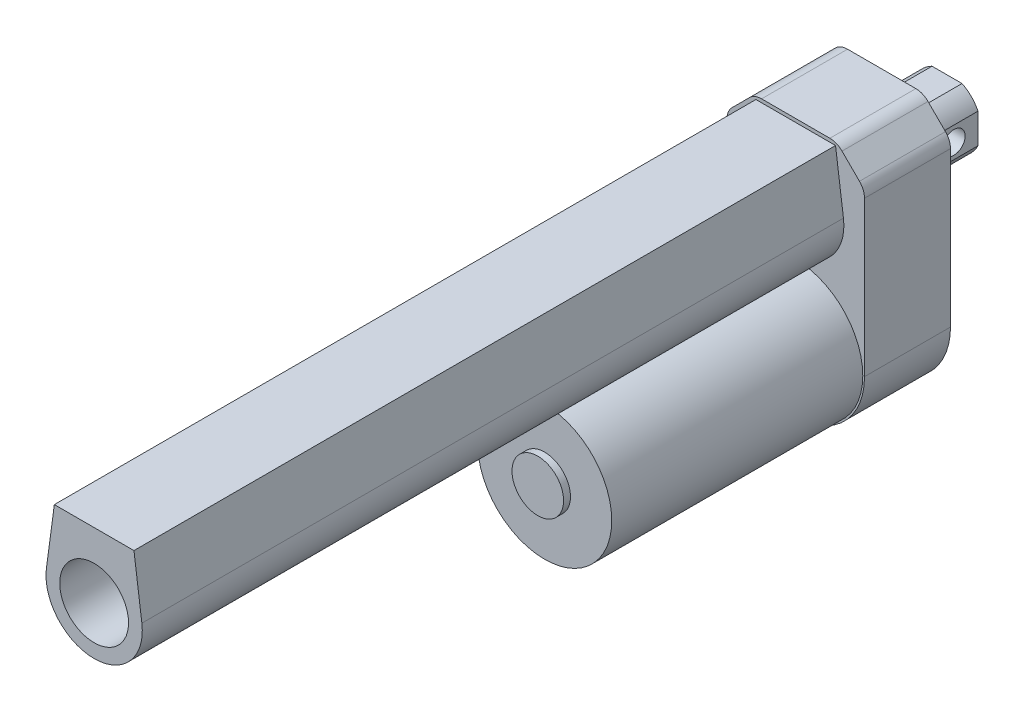
ISO-10303-21;
HEADER;
FILE_DESCRIPTION(('STEP AP214'),'2;1');
FILE_NAME('part.step','',(''),(''),'','','');
FILE_SCHEMA(('AUTOMOTIVE_DESIGN { 1 0 10303 214 1 1 1 1 }'));
ENDSEC;
DATA;
#1=APPLICATION_CONTEXT('core data for automotive mechanical design processes');
#2=APPLICATION_PROTOCOL_DEFINITION('international standard','automotive_design',2000,#1);
#3=PRODUCT_CONTEXT('',#1,'mechanical');
#4=PRODUCT('Part','Part','',(#3));
#5=PRODUCT_RELATED_PRODUCT_CATEGORY('part','',(#4));
#6=PRODUCT_DEFINITION_FORMATION('','',#4);
#7=PRODUCT_DEFINITION_CONTEXT('part definition',#1,'design');
#8=PRODUCT_DEFINITION('design','',#6,#7);
#9=PRODUCT_DEFINITION_SHAPE('','',#8);
#10=(LENGTH_UNIT() NAMED_UNIT(*) SI_UNIT(.MILLI.,.METRE.));
#11=(NAMED_UNIT(*) PLANE_ANGLE_UNIT() SI_UNIT($,.RADIAN.));
#12=(NAMED_UNIT(*) SI_UNIT($,.STERADIAN.) SOLID_ANGLE_UNIT());
#13=UNCERTAINTY_MEASURE_WITH_UNIT(LENGTH_MEASURE(1.E-05),#10,'distance_accuracy_value','');
#14=(GEOMETRIC_REPRESENTATION_CONTEXT(3) GLOBAL_UNCERTAINTY_ASSIGNED_CONTEXT((#13)) GLOBAL_UNIT_ASSIGNED_CONTEXT((#10,
#11,#12)) REPRESENTATION_CONTEXT('',''));
#15=CARTESIAN_POINT('',(0.,0.,0.));
#16=DIRECTION('',(0.,0.,1.));
#17=DIRECTION('',(1.,0.,0.));
#18=AXIS2_PLACEMENT_3D('',#15,#16,#17);
#19=CARTESIAN_POINT('',(0.,35.,-19.));
#20=DIRECTION('',(0.,0.,1.));
#21=DIRECTION('',(1.,0.,0.));
#22=AXIS2_PLACEMENT_3D('',#19,#20,#21);
#23=CYLINDRICAL_SURFACE('',#22,10.);
#24=CARTESIAN_POINT('',(0.,35.,0.));
#25=DIRECTION('',(0.,0.,-1.));
#26=DIRECTION('',(-1.,0.,0.));
#27=AXIS2_PLACEMENT_3D('',#24,#25,#26);
#28=CIRCLE('',#27,10.);
#29=CARTESIAN_POINT('',(9.00000000000001,30.6411010564594,0.));
#30=VERTEX_POINT('',#29);
#31=CARTESIAN_POINT('',(4.35889894354065,26.,0.));
#32=VERTEX_POINT('',#31);
#33=EDGE_CURVE('E140',#30,#32,#28,.T.);
#34=ORIENTED_EDGE('',*,*,#33,.T.);
#35=DIRECTION('',(0.,0.,1.));
#36=VECTOR('',#35,1.);
#37=CARTESIAN_POINT('',(4.35889894354065,26.,-19.));
#38=LINE('',#37,#36);
#39=CARTESIAN_POINT('',(4.35889894354065,26.,-19.));
#40=VERTEX_POINT('',#39);
#41=EDGE_CURVE('E12',#40,#32,#38,.T.);
#42=ORIENTED_EDGE('',*,*,#41,.F.);
#43=CARTESIAN_POINT('',(0.,35.,-19.));
#44=DIRECTION('',(0.,0.,-1.));
#45=DIRECTION('',(-1.,0.,0.));
#46=AXIS2_PLACEMENT_3D('',#43,#44,#45);
#47=CIRCLE('',#46,10.);
#48=CARTESIAN_POINT('',(9.00000000000001,30.6411010564594,-19.));
#49=VERTEX_POINT('',#48);
#50=EDGE_CURVE('E155',#49,#40,#47,.T.);
#51=ORIENTED_EDGE('',*,*,#50,.F.);
#52=DIRECTION('',(0.,0.,1.));
#53=VECTOR('',#52,1.);
#54=CARTESIAN_POINT('',(9.00000000000001,30.6411010564594,-19.));
#55=LINE('',#54,#53);
#56=EDGE_CURVE('E136',#49,#30,#55,.T.);
#57=ORIENTED_EDGE('',*,*,#56,.T.);
#58=EDGE_LOOP('',(#34,#42,#51,#57));
#59=FACE_BOUND('',#58,.T.);
#60=ADVANCED_FACE('F44',(#59),#23,.T.);
#61=CARTESIAN_POINT('',(4.35889894354065,26.,-19.));
#62=DIRECTION('',(0.,1.,0.));
#63=DIRECTION('',(0.,0.,1.));
#64=AXIS2_PLACEMENT_3D('',#61,#62,#63);
#65=PLANE('',#64);
#66=DIRECTION('',(-1.,0.,0.));
#67=VECTOR('',#66,1.);
#68=CARTESIAN_POINT('',(4.35889894354065,26.,0.));
#69=LINE('',#68,#67);
#70=CARTESIAN_POINT('',(-4.35889894354066,26.,0.));
#71=VERTEX_POINT('',#70);
#72=EDGE_CURVE('E143',#32,#71,#69,.T.);
#73=ORIENTED_EDGE('',*,*,#72,.T.);
#74=DIRECTION('',(0.,0.,1.));
#75=VECTOR('',#74,1.);
#76=CARTESIAN_POINT('',(-4.35889894354066,26.,-19.));
#77=LINE('',#76,#75);
#78=CARTESIAN_POINT('',(-4.35889894354066,26.,-19.));
#79=VERTEX_POINT('',#78);
#80=EDGE_CURVE('E52',#79,#71,#77,.T.);
#81=ORIENTED_EDGE('',*,*,#80,.F.);
#82=DIRECTION('',(-1.,0.,0.));
#83=VECTOR('',#82,1.);
#84=CARTESIAN_POINT('',(4.35889894354065,26.,-19.));
#85=LINE('',#84,#83);
#86=EDGE_CURVE('E103',#40,#79,#85,.T.);
#87=ORIENTED_EDGE('',*,*,#86,.F.);
#88=ORIENTED_EDGE('',*,*,#41,.T.);
#89=EDGE_LOOP('',(#73,#81,#87,#88));
#90=FACE_BOUND('',#89,.T.);
#91=ADVANCED_FACE('F208',(#90),#65,.F.);
#92=CARTESIAN_POINT('',(0.,35.,-19.));
#93=DIRECTION('',(0.,0.,1.));
#94=DIRECTION('',(1.,0.,0.));
#95=AXIS2_PLACEMENT_3D('',#92,#93,#94);
#96=CYLINDRICAL_SURFACE('',#95,10.);
#97=CARTESIAN_POINT('',(0.,35.,0.));
#98=DIRECTION('',(0.,0.,-1.));
#99=DIRECTION('',(-1.,0.,0.));
#100=AXIS2_PLACEMENT_3D('',#97,#98,#99);
#101=CIRCLE('',#100,10.);
#102=CARTESIAN_POINT('',(-9.00000000000001,30.6411010564594,0.));
#103=VERTEX_POINT('',#102);
#104=EDGE_CURVE('E146',#71,#103,#101,.T.);
#105=ORIENTED_EDGE('',*,*,#104,.T.);
#106=DIRECTION('',(0.,0.,1.));
#107=VECTOR('',#106,1.);
#108=CARTESIAN_POINT('',(-9.00000000000001,30.6411010564594,-19.));
#109=LINE('',#108,#107);
#110=CARTESIAN_POINT('',(-9.00000000000001,30.6411010564594,-19.));
#111=VERTEX_POINT('',#110);
#112=EDGE_CURVE('E162',#111,#103,#109,.T.);
#113=ORIENTED_EDGE('',*,*,#112,.F.);
#114=CARTESIAN_POINT('',(0.,35.,-19.));
#115=DIRECTION('',(0.,0.,-1.));
#116=DIRECTION('',(-1.,0.,0.));
#117=AXIS2_PLACEMENT_3D('',#114,#115,#116);
#118=CIRCLE('',#117,10.);
#119=EDGE_CURVE('E170',#79,#111,#118,.T.);
#120=ORIENTED_EDGE('',*,*,#119,.F.);
#121=ORIENTED_EDGE('',*,*,#80,.T.);
#122=EDGE_LOOP('',(#105,#113,#120,#121));
#123=FACE_BOUND('',#122,.T.);
#124=ADVANCED_FACE('F168',(#123),#96,.T.);
#125=CARTESIAN_POINT('',(-9.,39.3588989435407,-19.));
#126=DIRECTION('',(1.,0.,0.));
#127=DIRECTION('',(0.,1.,0.));
#128=AXIS2_PLACEMENT_3D('',#125,#126,#127);
#129=PLANE('',#128);
#130=CARTESIAN_POINT('',(-9.00000000000001,35.,-12.));
#131=DIRECTION('',(1.,0.,0.));
#132=DIRECTION('',(0.,1.,0.));
#133=AXIS2_PLACEMENT_3D('',#130,#131,#132);
#134=CIRCLE('',#133,3.25);
#135=CARTESIAN_POINT('',(-9.,38.25,-12.));
#136=VERTEX_POINT('',#135);
#137=EDGE_CURVE('E144',#136,#136,#134,.T.);
#138=ORIENTED_EDGE('',*,*,#137,.T.);
#139=EDGE_LOOP('',(#138));
#140=FACE_BOUND('',#139,.T.);
#141=DIRECTION('',(0.,1.,0.));
#142=VECTOR('',#141,1.);
#143=CARTESIAN_POINT('',(-9.,39.3588989435407,0.));
#144=LINE('',#143,#142);
#145=CARTESIAN_POINT('',(-9.,39.3588989435407,0.));
#146=VERTEX_POINT('',#145);
#147=EDGE_CURVE('E148',#103,#146,#144,.T.);
#148=ORIENTED_EDGE('',*,*,#147,.T.);
#149=DIRECTION('',(0.,0.,1.));
#150=VECTOR('',#149,1.);
#151=CARTESIAN_POINT('',(-9.,39.3588989435407,-19.));
#152=LINE('',#151,#150);
#153=CARTESIAN_POINT('',(-9.,39.3588989435407,-19.));
#154=VERTEX_POINT('',#153);
#155=EDGE_CURVE('E159',#154,#146,#152,.T.);
#156=ORIENTED_EDGE('',*,*,#155,.F.);
#157=DIRECTION('',(0.,1.,0.));
#158=VECTOR('',#157,1.);
#159=CARTESIAN_POINT('',(-9.,39.3588989435407,-19.));
#160=LINE('',#159,#158);
#161=EDGE_CURVE('E182',#111,#154,#160,.T.);
#162=ORIENTED_EDGE('',*,*,#161,.F.);
#163=ORIENTED_EDGE('',*,*,#112,.T.);
#164=EDGE_LOOP('',(#148,#156,#162,#163));
#165=FACE_BOUND('',#164,.T.);
#166=ADVANCED_FACE('F178',(#140,#165),#129,.F.);
#167=CARTESIAN_POINT('',(0.,35.,-19.));
#168=DIRECTION('',(0.,0.,1.));
#169=DIRECTION('',(1.,0.,0.));
#170=AXIS2_PLACEMENT_3D('',#167,#168,#169);
#171=CYLINDRICAL_SURFACE('',#170,10.);
#172=CARTESIAN_POINT('',(0.,35.,0.));
#173=DIRECTION('',(0.,0.,-1.));
#174=DIRECTION('',(-1.,0.,0.));
#175=AXIS2_PLACEMENT_3D('',#172,#173,#174);
#176=CIRCLE('',#175,10.);
#177=CARTESIAN_POINT('',(-4.3588989435407,44.,0.));
#178=VERTEX_POINT('',#177);
#179=EDGE_CURVE('E150',#146,#178,#176,.T.);
#180=ORIENTED_EDGE('',*,*,#179,.T.);
#181=DIRECTION('',(0.,0.,1.));
#182=VECTOR('',#181,1.);
#183=CARTESIAN_POINT('',(-4.3588989435407,44.,-19.));
#184=LINE('',#183,#182);
#185=CARTESIAN_POINT('',(-4.3588989435407,44.,-19.));
#186=VERTEX_POINT('',#185);
#187=EDGE_CURVE('E131',#186,#178,#184,.T.);
#188=ORIENTED_EDGE('',*,*,#187,.F.);
#189=CARTESIAN_POINT('',(0.,35.,-19.));
#190=DIRECTION('',(0.,0.,-1.));
#191=DIRECTION('',(-1.,0.,0.));
#192=AXIS2_PLACEMENT_3D('',#189,#190,#191);
#193=CIRCLE('',#192,10.);
#194=EDGE_CURVE('E122',#154,#186,#193,.T.);
#195=ORIENTED_EDGE('',*,*,#194,.F.);
#196=ORIENTED_EDGE('',*,*,#155,.T.);
#197=EDGE_LOOP('',(#180,#188,#195,#196));
#198=FACE_BOUND('',#197,.T.);
#199=ADVANCED_FACE('F181',(#198),#171,.T.);
#200=CARTESIAN_POINT('',(4.3588989435407,44.,-19.));
#201=DIRECTION('',(0.,-1.,0.));
#202=DIRECTION('',(0.,0.,-1.));
#203=AXIS2_PLACEMENT_3D('',#200,#201,#202);
#204=PLANE('',#203);
#205=DIRECTION('',(1.,0.,0.));
#206=VECTOR('',#205,1.);
#207=CARTESIAN_POINT('',(4.3588989435407,44.,0.));
#208=LINE('',#207,#206);
#209=CARTESIAN_POINT('',(4.3588989435407,44.,0.));
#210=VERTEX_POINT('',#209);
#211=EDGE_CURVE('E130',#178,#210,#208,.T.);
#212=ORIENTED_EDGE('',*,*,#211,.T.);
#213=DIRECTION('',(0.,0.,1.));
#214=VECTOR('',#213,1.);
#215=CARTESIAN_POINT('',(4.3588989435407,44.,-19.));
#216=LINE('',#215,#214);
#217=CARTESIAN_POINT('',(4.3588989435407,44.,-19.));
#218=VERTEX_POINT('',#217);
#219=EDGE_CURVE('E127',#218,#210,#216,.T.);
#220=ORIENTED_EDGE('',*,*,#219,.F.);
#221=DIRECTION('',(1.,0.,0.));
#222=VECTOR('',#221,1.);
#223=CARTESIAN_POINT('',(4.3588989435407,44.,-19.));
#224=LINE('',#223,#222);
#225=EDGE_CURVE('E116',#186,#218,#224,.T.);
#226=ORIENTED_EDGE('',*,*,#225,.F.);
#227=ORIENTED_EDGE('',*,*,#187,.T.);
#228=EDGE_LOOP('',(#212,#220,#226,#227));
#229=FACE_BOUND('',#228,.T.);
#230=ADVANCED_FACE('F128',(#229),#204,.F.);
#231=CARTESIAN_POINT('',(0.,35.,-19.));
#232=DIRECTION('',(0.,0.,1.));
#233=DIRECTION('',(1.,0.,0.));
#234=AXIS2_PLACEMENT_3D('',#231,#232,#233);
#235=CYLINDRICAL_SURFACE('',#234,10.);
#236=CARTESIAN_POINT('',(0.,35.,0.));
#237=DIRECTION('',(0.,0.,-1.));
#238=DIRECTION('',(-1.,0.,0.));
#239=AXIS2_PLACEMENT_3D('',#236,#237,#238);
#240=CIRCLE('',#239,10.);
#241=CARTESIAN_POINT('',(9.00000000000001,39.3588989435407,0.));
#242=VERTEX_POINT('',#241);
#243=EDGE_CURVE('E89',#210,#242,#240,.T.);
#244=ORIENTED_EDGE('',*,*,#243,.T.);
#245=DIRECTION('',(0.,0.,1.));
#246=VECTOR('',#245,1.);
#247=CARTESIAN_POINT('',(9.00000000000001,39.3588989435407,-19.));
#248=LINE('',#247,#246);
#249=CARTESIAN_POINT('',(9.00000000000001,39.3588989435407,-19.));
#250=VERTEX_POINT('',#249);
#251=EDGE_CURVE('E132',#250,#242,#248,.T.);
#252=ORIENTED_EDGE('',*,*,#251,.F.);
#253=CARTESIAN_POINT('',(0.,35.,-19.));
#254=DIRECTION('',(0.,0.,-1.));
#255=DIRECTION('',(-1.,0.,0.));
#256=AXIS2_PLACEMENT_3D('',#253,#254,#255);
#257=CIRCLE('',#256,10.);
#258=EDGE_CURVE('E120',#218,#250,#257,.T.);
#259=ORIENTED_EDGE('',*,*,#258,.F.);
#260=ORIENTED_EDGE('',*,*,#219,.T.);
#261=EDGE_LOOP('',(#244,#252,#259,#260));
#262=FACE_BOUND('',#261,.T.);
#263=ADVANCED_FACE('F134',(#262),#235,.T.);
#264=CARTESIAN_POINT('',(9.00000000000001,39.3588989435407,-19.));
#265=DIRECTION('',(-1.,0.,0.));
#266=DIRECTION('',(0.,0.,1.));
#267=AXIS2_PLACEMENT_3D('',#264,#265,#266);
#268=PLANE('',#267);
#269=CARTESIAN_POINT('',(9.00000000000001,35.,-12.));
#270=DIRECTION('',(1.,0.,0.));
#271=DIRECTION('',(0.,0.,-1.));
#272=AXIS2_PLACEMENT_3D('',#269,#270,#271);
#273=CIRCLE('',#272,3.25);
#274=CARTESIAN_POINT('',(9.00000000000001,35.,-15.25));
#275=VERTEX_POINT('',#274);
#276=EDGE_CURVE('E190',#275,#275,#273,.T.);
#277=ORIENTED_EDGE('',*,*,#276,.F.);
#278=EDGE_LOOP('',(#277));
#279=FACE_BOUND('',#278,.T.);
#280=DIRECTION('',(0.,-1.,0.));
#281=VECTOR('',#280,1.);
#282=CARTESIAN_POINT('',(9.00000000000001,39.3588989435407,0.));
#283=LINE('',#282,#281);
#284=EDGE_CURVE('E95',#242,#30,#283,.T.);
#285=ORIENTED_EDGE('',*,*,#284,.T.);
#286=ORIENTED_EDGE('',*,*,#56,.F.);
#287=DIRECTION('',(0.,-1.,0.));
#288=VECTOR('',#287,1.);
#289=CARTESIAN_POINT('',(9.00000000000001,39.3588989435407,-19.));
#290=LINE('',#289,#288);
#291=EDGE_CURVE('E60',#250,#49,#290,.T.);
#292=ORIENTED_EDGE('',*,*,#291,.F.);
#293=ORIENTED_EDGE('',*,*,#251,.T.);
#294=EDGE_LOOP('',(#285,#286,#292,#293));
#295=FACE_BOUND('',#294,.T.);
#296=ADVANCED_FACE('F197',(#279,#295),#268,.F.);
#297=CARTESIAN_POINT('',(0.,35.,-19.));
#298=DIRECTION('',(0.,0.,-1.));
#299=DIRECTION('',(-1.,0.,0.));
#300=AXIS2_PLACEMENT_3D('',#297,#298,#299);
#301=PLANE('',#300);
#302=ORIENTED_EDGE('',*,*,#50,.T.);
#303=ORIENTED_EDGE('',*,*,#86,.T.);
#304=ORIENTED_EDGE('',*,*,#119,.T.);
#305=ORIENTED_EDGE('',*,*,#161,.T.);
#306=ORIENTED_EDGE('',*,*,#194,.T.);
#307=ORIENTED_EDGE('',*,*,#225,.T.);
#308=ORIENTED_EDGE('',*,*,#258,.T.);
#309=ORIENTED_EDGE('',*,*,#291,.T.);
#310=EDGE_LOOP('',(#302,#303,#304,#305,#306,#307,#308,#309));
#311=FACE_BOUND('',#310,.T.);
#312=ADVANCED_FACE('F118',(#311),#301,.T.);
#313=CARTESIAN_POINT('',(0.,35.,0.));
#314=DIRECTION('',(0.,0.,-1.));
#315=DIRECTION('',(-1.,0.,0.));
#316=AXIS2_PLACEMENT_3D('',#313,#314,#315);
#317=PLANE('',#316);
#318=ORIENTED_EDGE('',*,*,#33,.F.);
#319=ORIENTED_EDGE('',*,*,#284,.F.);
#320=ORIENTED_EDGE('',*,*,#243,.F.);
#321=ORIENTED_EDGE('',*,*,#211,.F.);
#322=ORIENTED_EDGE('',*,*,#179,.F.);
#323=ORIENTED_EDGE('',*,*,#147,.F.);
#324=ORIENTED_EDGE('',*,*,#104,.F.);
#325=ORIENTED_EDGE('',*,*,#72,.F.);
#326=EDGE_LOOP('',(#318,#319,#320,#321,#322,#323,#324,#325));
#327=FACE_BOUND('',#326,.T.);
#328=ADVANCED_FACE('F174',(#327),#317,.F.);
#329=CARTESIAN_POINT('',(-11.,35.,-12.));
#330=DIRECTION('',(1.,0.,0.));
#331=DIRECTION('',(0.,0.,-1.));
#332=AXIS2_PLACEMENT_3D('',#329,#330,#331);
#333=CYLINDRICAL_SURFACE('',#332,3.25);
#334=ORIENTED_EDGE('',*,*,#276,.T.);
#335=EDGE_LOOP('',(#334));
#336=FACE_BOUND('',#335,.T.);
#337=ORIENTED_EDGE('',*,*,#137,.F.);
#338=EDGE_LOOP('',(#337));
#339=FACE_BOUND('',#338,.T.);
#340=ADVANCED_FACE('F194',(#336,#339),#333,.F.);
#341=CLOSED_SHELL('',(#60,#91,#124,#166,#199,#230,#263,#296,#312,#328,#340));
#342=MANIFOLD_SOLID_BREP('B2',#341);
#343=CARTESIAN_POINT('',(0.,0.,25.));
#344=DIRECTION('',(0.,0.,1.));
#345=DIRECTION('',(1.,0.,0.));
#346=AXIS2_PLACEMENT_3D('',#343,#344,#345);
#347=PLANE('',#346);
#348=CARTESIAN_POINT('',(0.,0.,25.));
#349=DIRECTION('',(0.,0.,1.));
#350=DIRECTION('',(1.,0.,0.));
#351=AXIS2_PLACEMENT_3D('',#348,#349,#350);
#352=CIRCLE('',#351,19.5);
#353=CARTESIAN_POINT('',(19.5,0.,25.));
#354=VERTEX_POINT('',#353);
#355=EDGE_CURVE('E301',#354,#354,#352,.T.);
#356=ORIENTED_EDGE('',*,*,#355,.F.);
#357=EDGE_LOOP('',(#356));
#358=FACE_BOUND('',#357,.T.);
#359=CARTESIAN_POINT('',(0.,0.,25.));
#360=DIRECTION('',(0.,0.,1.));
#361=DIRECTION('',(1.,0.,0.));
#362=AXIS2_PLACEMENT_3D('',#359,#360,#361);
#363=CIRCLE('',#362,20.);
#364=CARTESIAN_POINT('',(-20.,0.,25.));
#365=VERTEX_POINT('',#364);
#366=CARTESIAN_POINT('',(20.,0.,25.));
#367=VERTEX_POINT('',#366);
#368=EDGE_CURVE('E436',#365,#367,#363,.T.);
#369=ORIENTED_EDGE('',*,*,#368,.T.);
#370=DIRECTION('',(0.,1.,0.));
#371=VECTOR('',#370,1.);
#372=CARTESIAN_POINT('',(20.,44.9289321881345,25.));
#373=LINE('',#372,#371);
#374=CARTESIAN_POINT('',(20.,44.9289321881345,25.));
#375=VERTEX_POINT('',#374);
#376=EDGE_CURVE('E366',#367,#375,#373,.T.);
#377=ORIENTED_EDGE('',*,*,#376,.T.);
#378=CARTESIAN_POINT('',(15.,44.9289321881345,25.));
#379=DIRECTION('',(0.,0.,1.));
#380=DIRECTION('',(1.,0.,0.));
#381=AXIS2_PLACEMENT_3D('',#378,#379,#380);
#382=CIRCLE('',#381,5.);
#383=CARTESIAN_POINT('',(18.5355339059327,48.4644660940673,25.));
#384=VERTEX_POINT('',#383);
#385=EDGE_CURVE('E465',#375,#384,#382,.T.);
#386=ORIENTED_EDGE('',*,*,#385,.T.);
#387=DIRECTION('',(-0.707106781186547,0.707106781186548,0.));
#388=VECTOR('',#387,1.);
#389=CARTESIAN_POINT('',(13.4644660940673,53.5355339059327,25.));
#390=LINE('',#389,#388);
#391=CARTESIAN_POINT('',(13.4644660940673,53.5355339059327,25.));
#392=VERTEX_POINT('',#391);
#393=EDGE_CURVE('E467',#384,#392,#390,.T.);
#394=ORIENTED_EDGE('',*,*,#393,.T.);
#395=CARTESIAN_POINT('',(9.92893218813453,50.,25.));
#396=DIRECTION('',(0.,0.,1.));
#397=DIRECTION('',(1.,0.,0.));
#398=AXIS2_PLACEMENT_3D('',#395,#396,#397);
#399=CIRCLE('',#398,5.);
#400=CARTESIAN_POINT('',(9.92893218813453,55.,25.));
#401=VERTEX_POINT('',#400);
#402=EDGE_CURVE('E469',#392,#401,#399,.T.);
#403=ORIENTED_EDGE('',*,*,#402,.T.);
#404=DIRECTION('',(-1.,0.,0.));
#405=VECTOR('',#404,1.);
#406=CARTESIAN_POINT('',(-9.92893218813452,55.,25.));
#407=LINE('',#406,#405);
#408=CARTESIAN_POINT('',(-9.92893218813452,55.,25.));
#409=VERTEX_POINT('',#408);
#410=EDGE_CURVE('E471',#401,#409,#407,.T.);
#411=ORIENTED_EDGE('',*,*,#410,.T.);
#412=CARTESIAN_POINT('',(-9.92893218813452,50.,25.));
#413=DIRECTION('',(0.,0.,1.));
#414=DIRECTION('',(-1.,0.,0.));
#415=AXIS2_PLACEMENT_3D('',#412,#413,#414);
#416=CIRCLE('',#415,5.);
#417=CARTESIAN_POINT('',(-13.4644660940673,53.5355339059327,25.));
#418=VERTEX_POINT('',#417);
#419=EDGE_CURVE('E395',#409,#418,#416,.T.);
#420=ORIENTED_EDGE('',*,*,#419,.T.);
#421=DIRECTION('',(-0.707106781186547,-0.707106781186548,0.));
#422=VECTOR('',#421,1.);
#423=CARTESIAN_POINT('',(-18.5355339059327,48.4644660940673,25.));
#424=LINE('',#423,#422);
#425=CARTESIAN_POINT('',(-18.5355339059327,48.4644660940673,25.));
#426=VERTEX_POINT('',#425);
#427=EDGE_CURVE('E388',#418,#426,#424,.T.);
#428=ORIENTED_EDGE('',*,*,#427,.T.);
#429=CARTESIAN_POINT('',(-15.,44.9289321881345,25.));
#430=DIRECTION('',(0.,0.,1.));
#431=DIRECTION('',(-1.,0.,0.));
#432=AXIS2_PLACEMENT_3D('',#429,#430,#431);
#433=CIRCLE('',#432,5.);
#434=CARTESIAN_POINT('',(-20.,44.9289321881345,25.));
#435=VERTEX_POINT('',#434);
#436=EDGE_CURVE('E392',#426,#435,#433,.T.);
#437=ORIENTED_EDGE('',*,*,#436,.T.);
#438=DIRECTION('',(0.,-1.,0.));
#439=VECTOR('',#438,1.);
#440=CARTESIAN_POINT('',(-20.,0.,25.));
#441=LINE('',#440,#439);
#442=EDGE_CURVE('E318',#435,#365,#441,.T.);
#443=ORIENTED_EDGE('',*,*,#442,.T.);
#444=EDGE_LOOP('',(#369,#377,#386,#394,#403,#411,#420,#428,#437,#443));
#445=FACE_BOUND('',#444,.T.);
#446=DIRECTION('',(-0.13296122052609,-0.991121240735064,0.));
#447=VECTOR('',#446,1.);
#448=CARTESIAN_POINT('',(-11.5765219616268,54.,25.));
#449=LINE('',#448,#447);
#450=CARTESIAN_POINT('',(-11.5765219616268,54.,25.));
#451=VERTEX_POINT('',#450);
#452=CARTESIAN_POINT('',(-13.8756973702909,36.8614570873653,25.));
#453=VERTEX_POINT('',#452);
#454=EDGE_CURVE('E704',#451,#453,#449,.T.);
#455=ORIENTED_EDGE('',*,*,#454,.F.);
#456=DIRECTION('',(-1.,0.,0.));
#457=VECTOR('',#456,1.);
#458=CARTESIAN_POINT('',(-11.5765219616268,54.,25.));
#459=LINE('',#458,#457);
#460=CARTESIAN_POINT('',(11.5765219616268,54.,25.));
#461=VERTEX_POINT('',#460);
#462=EDGE_CURVE('E701',#461,#451,#459,.T.);
#463=ORIENTED_EDGE('',*,*,#462,.F.);
#464=DIRECTION('',(-0.13296122052609,0.991121240735064,0.));
#465=VECTOR('',#464,1.);
#466=CARTESIAN_POINT('',(11.5765219616268,54.,25.));
#467=LINE('',#466,#465);
#468=CARTESIAN_POINT('',(13.8756973702909,36.8614570873653,25.));
#469=VERTEX_POINT('',#468);
#470=EDGE_CURVE('E712',#469,#461,#467,.T.);
#471=ORIENTED_EDGE('',*,*,#470,.F.);
#472=CARTESIAN_POINT('',(0.,35.,25.));
#473=DIRECTION('',(0.,0.,1.));
#474=DIRECTION('',(1.,0.,0.));
#475=AXIS2_PLACEMENT_3D('',#472,#473,#474);
#476=CIRCLE('',#475,14.);
#477=EDGE_CURVE('E724',#453,#469,#476,.T.);
#478=ORIENTED_EDGE('',*,*,#477,.F.);
#479=EDGE_LOOP('',(#455,#463,#471,#478));
#480=FACE_BOUND('',#479,.T.);
#481=ADVANCED_FACE('F292',(#358,#445,#480),#347,.T.);
#482=CARTESIAN_POINT('',(0.,0.,25.));
#483=DIRECTION('',(0.,0.,-1.));
#484=DIRECTION('',(-1.,0.,0.));
#485=AXIS2_PLACEMENT_3D('',#482,#483,#484);
#486=CYLINDRICAL_SURFACE('',#485,20.);
#487=CARTESIAN_POINT('',(0.,0.,0.));
#488=DIRECTION('',(0.,0.,1.));
#489=DIRECTION('',(1.,0.,0.));
#490=AXIS2_PLACEMENT_3D('',#487,#488,#489);
#491=CIRCLE('',#490,20.);
#492=CARTESIAN_POINT('',(-20.,0.,0.));
#493=VERTEX_POINT('',#492);
#494=CARTESIAN_POINT('',(20.,0.,0.));
#495=VERTEX_POINT('',#494);
#496=EDGE_CURVE('E416',#493,#495,#491,.T.);
#497=ORIENTED_EDGE('',*,*,#496,.T.);
#498=DIRECTION('',(0.,0.,-1.));
#499=VECTOR('',#498,1.);
#500=CARTESIAN_POINT('',(20.,0.,25.));
#501=LINE('',#500,#499);
#502=EDGE_CURVE('E296',#367,#495,#501,.T.);
#503=ORIENTED_EDGE('',*,*,#502,.F.);
#504=ORIENTED_EDGE('',*,*,#368,.F.);
#505=DIRECTION('',(0.,0.,-1.));
#506=VECTOR('',#505,1.);
#507=CARTESIAN_POINT('',(-20.,0.,25.));
#508=LINE('',#507,#506);
#509=EDGE_CURVE('E412',#365,#493,#508,.T.);
#510=ORIENTED_EDGE('',*,*,#509,.T.);
#511=EDGE_LOOP('',(#497,#503,#504,#510));
#512=FACE_BOUND('',#511,.T.);
#513=ADVANCED_FACE('F294',(#512),#486,.T.);
#514=CARTESIAN_POINT('',(20.,44.9289321881345,25.));
#515=DIRECTION('',(-1.,0.,0.));
#516=DIRECTION('',(0.,-1.,0.));
#517=AXIS2_PLACEMENT_3D('',#514,#515,#516);
#518=PLANE('',#517);
#519=DIRECTION('',(0.,1.,0.));
#520=VECTOR('',#519,1.);
#521=CARTESIAN_POINT('',(20.,44.9289321881345,0.));
#522=LINE('',#521,#520);
#523=CARTESIAN_POINT('',(20.,44.9289321881345,0.));
#524=VERTEX_POINT('',#523);
#525=EDGE_CURVE('E419',#495,#524,#522,.T.);
#526=ORIENTED_EDGE('',*,*,#525,.T.);
#527=DIRECTION('',(0.,0.,-1.));
#528=VECTOR('',#527,1.);
#529=CARTESIAN_POINT('',(20.,44.9289321881345,25.));
#530=LINE('',#529,#528);
#531=EDGE_CURVE('E451',#375,#524,#530,.T.);
#532=ORIENTED_EDGE('',*,*,#531,.F.);
#533=ORIENTED_EDGE('',*,*,#376,.F.);
#534=ORIENTED_EDGE('',*,*,#502,.T.);
#535=EDGE_LOOP('',(#526,#532,#533,#534));
#536=FACE_BOUND('',#535,.T.);
#537=ADVANCED_FACE('F489',(#536),#518,.F.);
#538=CARTESIAN_POINT('',(15.,44.9289321881345,25.));
#539=DIRECTION('',(0.,0.,-1.));
#540=DIRECTION('',(-1.,0.,0.));
#541=AXIS2_PLACEMENT_3D('',#538,#539,#540);
#542=CYLINDRICAL_SURFACE('',#541,5.);
#543=CARTESIAN_POINT('',(15.,44.9289321881345,0.));
#544=DIRECTION('',(0.,0.,1.));
#545=DIRECTION('',(1.,0.,0.));
#546=AXIS2_PLACEMENT_3D('',#543,#544,#545);
#547=CIRCLE('',#546,5.);
#548=CARTESIAN_POINT('',(18.5355339059327,48.4644660940673,0.));
#549=VERTEX_POINT('',#548);
#550=EDGE_CURVE('E422',#524,#549,#547,.T.);
#551=ORIENTED_EDGE('',*,*,#550,.T.);
#552=DIRECTION('',(0.,0.,-1.));
#553=VECTOR('',#552,1.);
#554=CARTESIAN_POINT('',(18.5355339059327,48.4644660940673,25.));
#555=LINE('',#554,#553);
#556=EDGE_CURVE('E449',#384,#549,#555,.T.);
#557=ORIENTED_EDGE('',*,*,#556,.F.);
#558=ORIENTED_EDGE('',*,*,#385,.F.);
#559=ORIENTED_EDGE('',*,*,#531,.T.);
#560=EDGE_LOOP('',(#551,#557,#558,#559));
#561=FACE_BOUND('',#560,.T.);
#562=ADVANCED_FACE('F490',(#561),#542,.T.);
#563=CARTESIAN_POINT('',(13.4644660940673,53.5355339059327,25.));
#564=DIRECTION('',(-0.707106781186548,-0.707106781186547,0.));
#565=DIRECTION('',(0.707106781186547,-0.707106781186548,0.));
#566=AXIS2_PLACEMENT_3D('',#563,#564,#565);
#567=PLANE('',#566);
#568=DIRECTION('',(-0.707106781186547,0.707106781186548,0.));
#569=VECTOR('',#568,1.);
#570=CARTESIAN_POINT('',(13.4644660940673,53.5355339059327,0.));
#571=LINE('',#570,#569);
#572=CARTESIAN_POINT('',(13.4644660940673,53.5355339059327,0.));
#573=VERTEX_POINT('',#572);
#574=EDGE_CURVE('E424',#549,#573,#571,.T.);
#575=ORIENTED_EDGE('',*,*,#574,.T.);
#576=DIRECTION('',(0.,0.,-1.));
#577=VECTOR('',#576,1.);
#578=CARTESIAN_POINT('',(13.4644660940673,53.5355339059327,25.));
#579=LINE('',#578,#577);
#580=EDGE_CURVE('E446',#392,#573,#579,.T.);
#581=ORIENTED_EDGE('',*,*,#580,.F.);
#582=ORIENTED_EDGE('',*,*,#393,.F.);
#583=ORIENTED_EDGE('',*,*,#556,.T.);
#584=EDGE_LOOP('',(#575,#581,#582,#583));
#585=FACE_BOUND('',#584,.T.);
#586=ADVANCED_FACE('F495',(#585),#567,.F.);
#587=CARTESIAN_POINT('',(9.92893218813453,50.,25.));
#588=DIRECTION('',(0.,0.,-1.));
#589=DIRECTION('',(-1.,0.,0.));
#590=AXIS2_PLACEMENT_3D('',#587,#588,#589);
#591=CYLINDRICAL_SURFACE('',#590,5.);
#592=CARTESIAN_POINT('',(9.92893218813453,50.,0.));
#593=DIRECTION('',(0.,0.,1.));
#594=DIRECTION('',(1.,0.,0.));
#595=AXIS2_PLACEMENT_3D('',#592,#593,#594);
#596=CIRCLE('',#595,5.);
#597=CARTESIAN_POINT('',(9.92893218813453,55.,0.));
#598=VERTEX_POINT('',#597);
#599=EDGE_CURVE('E426',#573,#598,#596,.T.);
#600=ORIENTED_EDGE('',*,*,#599,.T.);
#601=DIRECTION('',(0.,0.,-1.));
#602=VECTOR('',#601,1.);
#603=CARTESIAN_POINT('',(9.92893218813453,55.,25.));
#604=LINE('',#603,#602);
#605=EDGE_CURVE('E443',#401,#598,#604,.T.);
#606=ORIENTED_EDGE('',*,*,#605,.F.);
#607=ORIENTED_EDGE('',*,*,#402,.F.);
#608=ORIENTED_EDGE('',*,*,#580,.T.);
#609=EDGE_LOOP('',(#600,#606,#607,#608));
#610=FACE_BOUND('',#609,.T.);
#611=ADVANCED_FACE('F498',(#610),#591,.T.);
#612=CARTESIAN_POINT('',(-9.92893218813452,55.,25.));
#613=DIRECTION('',(0.,-1.,0.));
#614=DIRECTION('',(0.,0.,-1.));
#615=AXIS2_PLACEMENT_3D('',#612,#613,#614);
#616=PLANE('',#615);
#617=DIRECTION('',(-1.,0.,0.));
#618=VECTOR('',#617,1.);
#619=CARTESIAN_POINT('',(-9.92893218813452,55.,0.));
#620=LINE('',#619,#618);
#621=CARTESIAN_POINT('',(-9.92893218813452,55.,0.));
#622=VERTEX_POINT('',#621);
#623=EDGE_CURVE('E428',#598,#622,#620,.T.);
#624=ORIENTED_EDGE('',*,*,#623,.T.);
#625=DIRECTION('',(0.,0.,-1.));
#626=VECTOR('',#625,1.);
#627=CARTESIAN_POINT('',(-9.92893218813452,55.,25.));
#628=LINE('',#627,#626);
#629=EDGE_CURVE('E440',#409,#622,#628,.T.);
#630=ORIENTED_EDGE('',*,*,#629,.F.);
#631=ORIENTED_EDGE('',*,*,#410,.F.);
#632=ORIENTED_EDGE('',*,*,#605,.T.);
#633=EDGE_LOOP('',(#624,#630,#631,#632));
#634=FACE_BOUND('',#633,.T.);
#635=ADVANCED_FACE('F477',(#634),#616,.F.);
#636=CARTESIAN_POINT('',(-9.92893218813452,50.,25.));
#637=DIRECTION('',(0.,0.,-1.));
#638=DIRECTION('',(-1.,0.,0.));
#639=AXIS2_PLACEMENT_3D('',#636,#637,#638);
#640=CYLINDRICAL_SURFACE('',#639,5.);
#641=CARTESIAN_POINT('',(-9.92893218813452,50.,0.));
#642=DIRECTION('',(0.,0.,1.));
#643=DIRECTION('',(-1.,0.,0.));
#644=AXIS2_PLACEMENT_3D('',#641,#642,#643);
#645=CIRCLE('',#644,5.);
#646=CARTESIAN_POINT('',(-13.4644660940673,53.5355339059327,0.));
#647=VERTEX_POINT('',#646);
#648=EDGE_CURVE('E430',#622,#647,#645,.T.);
#649=ORIENTED_EDGE('',*,*,#648,.T.);
#650=DIRECTION('',(0.,0.,-1.));
#651=VECTOR('',#650,1.);
#652=CARTESIAN_POINT('',(-13.4644660940673,53.5355339059327,25.));
#653=LINE('',#652,#651);
#654=EDGE_CURVE('E407',#418,#647,#653,.T.);
#655=ORIENTED_EDGE('',*,*,#654,.F.);
#656=ORIENTED_EDGE('',*,*,#419,.F.);
#657=ORIENTED_EDGE('',*,*,#629,.T.);
#658=EDGE_LOOP('',(#649,#655,#656,#657));
#659=FACE_BOUND('',#658,.T.);
#660=ADVANCED_FACE('F481',(#659),#640,.T.);
#661=CARTESIAN_POINT('',(-18.5355339059327,48.4644660940673,25.));
#662=DIRECTION('',(0.707106781186548,-0.707106781186547,0.));
#663=DIRECTION('',(0.707106781186547,0.707106781186548,0.));
#664=AXIS2_PLACEMENT_3D('',#661,#662,#663);
#665=PLANE('',#664);
#666=DIRECTION('',(-0.707106781186547,-0.707106781186548,0.));
#667=VECTOR('',#666,1.);
#668=CARTESIAN_POINT('',(-18.5355339059327,48.4644660940673,0.));
#669=LINE('',#668,#667);
#670=CARTESIAN_POINT('',(-18.5355339059327,48.4644660940673,0.));
#671=VERTEX_POINT('',#670);
#672=EDGE_CURVE('E404',#647,#671,#669,.T.);
#673=ORIENTED_EDGE('',*,*,#672,.T.);
#674=DIRECTION('',(0.,0.,-1.));
#675=VECTOR('',#674,1.);
#676=CARTESIAN_POINT('',(-18.5355339059327,48.4644660940673,25.));
#677=LINE('',#676,#675);
#678=EDGE_CURVE('E401',#426,#671,#677,.T.);
#679=ORIENTED_EDGE('',*,*,#678,.F.);
#680=ORIENTED_EDGE('',*,*,#427,.F.);
#681=ORIENTED_EDGE('',*,*,#654,.T.);
#682=EDGE_LOOP('',(#673,#679,#680,#681));
#683=FACE_BOUND('',#682,.T.);
#684=ADVANCED_FACE('F402',(#683),#665,.F.);
#685=CARTESIAN_POINT('',(-15.,44.9289321881345,25.));
#686=DIRECTION('',(0.,0.,-1.));
#687=DIRECTION('',(-1.,0.,0.));
#688=AXIS2_PLACEMENT_3D('',#685,#686,#687);
#689=CYLINDRICAL_SURFACE('',#688,5.);
#690=CARTESIAN_POINT('',(-15.,44.9289321881345,0.));
#691=DIRECTION('',(0.,0.,1.));
#692=DIRECTION('',(-1.,0.,0.));
#693=AXIS2_PLACEMENT_3D('',#690,#691,#692);
#694=CIRCLE('',#693,5.);
#695=CARTESIAN_POINT('',(-20.,44.9289321881345,0.));
#696=VERTEX_POINT('',#695);
#697=EDGE_CURVE('E433',#671,#696,#694,.T.);
#698=ORIENTED_EDGE('',*,*,#697,.T.);
#699=DIRECTION('',(0.,0.,-1.));
#700=VECTOR('',#699,1.);
#701=CARTESIAN_POINT('',(-20.,44.9289321881345,25.));
#702=LINE('',#701,#700);
#703=EDGE_CURVE('E408',#435,#696,#702,.T.);
#704=ORIENTED_EDGE('',*,*,#703,.F.);
#705=ORIENTED_EDGE('',*,*,#436,.F.);
#706=ORIENTED_EDGE('',*,*,#678,.T.);
#707=EDGE_LOOP('',(#698,#704,#705,#706));
#708=FACE_BOUND('',#707,.T.);
#709=ADVANCED_FACE('F410',(#708),#689,.T.);
#710=CARTESIAN_POINT('',(-20.,0.,25.));
#711=DIRECTION('',(1.,0.,0.));
#712=DIRECTION('',(0.,0.,-1.));
#713=AXIS2_PLACEMENT_3D('',#710,#711,#712);
#714=PLANE('',#713);
#715=DIRECTION('',(0.,-1.,0.));
#716=VECTOR('',#715,1.);
#717=CARTESIAN_POINT('',(-20.,0.,0.));
#718=LINE('',#717,#716);
#719=EDGE_CURVE('E357',#696,#493,#718,.T.);
#720=ORIENTED_EDGE('',*,*,#719,.T.);
#721=ORIENTED_EDGE('',*,*,#509,.F.);
#722=ORIENTED_EDGE('',*,*,#442,.F.);
#723=ORIENTED_EDGE('',*,*,#703,.T.);
#724=EDGE_LOOP('',(#720,#721,#722,#723));
#725=FACE_BOUND('',#724,.T.);
#726=ADVANCED_FACE('F485',(#725),#714,.F.);
#727=CARTESIAN_POINT('',(0.,0.,0.));
#728=DIRECTION('',(0.,0.,1.));
#729=DIRECTION('',(1.,0.,0.));
#730=AXIS2_PLACEMENT_3D('',#727,#728,#729);
#731=PLANE('',#730);
#732=CARTESIAN_POINT('',(0.,35.,0.));
#733=DIRECTION('',(0.,0.,1.));
#734=DIRECTION('',(1.,0.,0.));
#735=AXIS2_PLACEMENT_3D('',#732,#733,#734);
#736=CIRCLE('',#735,10.);
#737=CARTESIAN_POINT('',(10.,35.,0.));
#738=VERTEX_POINT('',#737);
#739=EDGE_CURVE('E700',#738,#738,#736,.T.);
#740=ORIENTED_EDGE('',*,*,#739,.T.);
#741=EDGE_LOOP('',(#740));
#742=FACE_BOUND('',#741,.T.);
#743=ORIENTED_EDGE('',*,*,#496,.F.);
#744=ORIENTED_EDGE('',*,*,#719,.F.);
#745=ORIENTED_EDGE('',*,*,#697,.F.);
#746=ORIENTED_EDGE('',*,*,#672,.F.);
#747=ORIENTED_EDGE('',*,*,#648,.F.);
#748=ORIENTED_EDGE('',*,*,#623,.F.);
#749=ORIENTED_EDGE('',*,*,#599,.F.);
#750=ORIENTED_EDGE('',*,*,#574,.F.);
#751=ORIENTED_EDGE('',*,*,#550,.F.);
#752=ORIENTED_EDGE('',*,*,#525,.F.);
#753=EDGE_LOOP('',(#743,#744,#745,#746,#747,#748,#749,#750,#751,#752));
#754=FACE_BOUND('',#753,.T.);
#755=ADVANCED_FACE('F484',(#742,#754),#731,.F.);
#756=CARTESIAN_POINT('',(0.,0.,98.));
#757=DIRECTION('',(0.,0.,-1.));
#758=DIRECTION('',(-1.,0.,0.));
#759=AXIS2_PLACEMENT_3D('',#756,#757,#758);
#760=CYLINDRICAL_SURFACE('',#759,19.5);
#761=CARTESIAN_POINT('',(0.,0.,98.));
#762=DIRECTION('',(0.,0.,1.));
#763=DIRECTION('',(1.,0.,0.));
#764=AXIS2_PLACEMENT_3D('',#761,#762,#763);
#765=CIRCLE('',#764,19.5);
#766=CARTESIAN_POINT('',(19.5,0.,98.));
#767=VERTEX_POINT('',#766);
#768=EDGE_CURVE('E420',#767,#767,#765,.T.);
#769=ORIENTED_EDGE('',*,*,#768,.F.);
#770=EDGE_LOOP('',(#769));
#771=FACE_BOUND('',#770,.T.);
#772=ORIENTED_EDGE('',*,*,#355,.T.);
#773=EDGE_LOOP('',(#772));
#774=FACE_BOUND('',#773,.T.);
#775=ADVANCED_FACE('F515',(#771,#774),#760,.T.);
#776=CARTESIAN_POINT('',(0.,0.,98.));
#777=DIRECTION('',(0.,0.,1.));
#778=DIRECTION('',(1.,0.,0.));
#779=AXIS2_PLACEMENT_3D('',#776,#777,#778);
#780=PLANE('',#779);
#781=CARTESIAN_POINT('',(0.,0.,98.));
#782=DIRECTION('',(0.,0.,1.));
#783=DIRECTION('',(1.,0.,0.));
#784=AXIS2_PLACEMENT_3D('',#781,#782,#783);
#785=CIRCLE('',#784,7.5);
#786=CARTESIAN_POINT('',(7.5,0.,98.));
#787=VERTEX_POINT('',#786);
#788=EDGE_CURVE('E42',#787,#787,#785,.T.);
#789=ORIENTED_EDGE('',*,*,#788,.F.);
#790=EDGE_LOOP('',(#789));
#791=FACE_BOUND('',#790,.T.);
#792=ORIENTED_EDGE('',*,*,#768,.T.);
#793=EDGE_LOOP('',(#792));
#794=FACE_BOUND('',#793,.T.);
#795=ADVANCED_FACE('F555',(#791,#794),#780,.T.);
#796=CARTESIAN_POINT('',(0.,0.,100.));
#797=DIRECTION('',(0.,0.,-1.));
#798=DIRECTION('',(-1.,0.,0.));
#799=AXIS2_PLACEMENT_3D('',#796,#797,#798);
#800=CYLINDRICAL_SURFACE('',#799,7.5);
#801=CARTESIAN_POINT('',(0.,0.,100.));
#802=DIRECTION('',(0.,0.,1.));
#803=DIRECTION('',(1.,0.,0.));
#804=AXIS2_PLACEMENT_3D('',#801,#802,#803);
#805=CIRCLE('',#804,7.5);
#806=CARTESIAN_POINT('',(7.5,0.,100.));
#807=VERTEX_POINT('',#806);
#808=EDGE_CURVE('E736',#807,#807,#805,.T.);
#809=ORIENTED_EDGE('',*,*,#808,.F.);
#810=EDGE_LOOP('',(#809));
#811=FACE_BOUND('',#810,.T.);
#812=ORIENTED_EDGE('',*,*,#788,.T.);
#813=EDGE_LOOP('',(#812));
#814=FACE_BOUND('',#813,.T.);
#815=ADVANCED_FACE('F562',(#811,#814),#800,.T.);
#816=CARTESIAN_POINT('',(0.,0.,100.));
#817=DIRECTION('',(0.,0.,1.));
#818=DIRECTION('',(1.,0.,0.));
#819=AXIS2_PLACEMENT_3D('',#816,#817,#818);
#820=PLANE('',#819);
#821=ORIENTED_EDGE('',*,*,#808,.T.);
#822=EDGE_LOOP('',(#821));
#823=FACE_BOUND('',#822,.T.);
#824=ADVANCED_FACE('F569',(#823),#820,.T.);
#825=CARTESIAN_POINT('',(-11.5765219616268,54.,229.));
#826=DIRECTION('',(0.,-1.,0.));
#827=DIRECTION('',(0.,0.,-1.));
#828=AXIS2_PLACEMENT_3D('',#825,#826,#827);
#829=PLANE('',#828);
#830=ORIENTED_EDGE('',*,*,#462,.T.);
#831=DIRECTION('',(0.,0.,-1.));
#832=VECTOR('',#831,1.);
#833=CARTESIAN_POINT('',(-11.5765219616268,54.,229.));
#834=LINE('',#833,#832);
#835=CARTESIAN_POINT('',(-11.5765219616268,54.,229.));
#836=VERTEX_POINT('',#835);
#837=EDGE_CURVE('E733',#836,#451,#834,.T.);
#838=ORIENTED_EDGE('',*,*,#837,.F.);
#839=DIRECTION('',(-1.,0.,0.));
#840=VECTOR('',#839,1.);
#841=CARTESIAN_POINT('',(-11.5765219616268,54.,229.));
#842=LINE('',#841,#840);
#843=CARTESIAN_POINT('',(11.5765219616268,54.,229.));
#844=VERTEX_POINT('',#843);
#845=EDGE_CURVE('E708',#844,#836,#842,.T.);
#846=ORIENTED_EDGE('',*,*,#845,.F.);
#847=DIRECTION('',(0.,0.,-1.));
#848=VECTOR('',#847,1.);
#849=CARTESIAN_POINT('',(11.5765219616268,54.,229.));
#850=LINE('',#849,#848);
#851=EDGE_CURVE('E720',#844,#461,#850,.T.);
#852=ORIENTED_EDGE('',*,*,#851,.T.);
#853=EDGE_LOOP('',(#830,#838,#846,#852));
#854=FACE_BOUND('',#853,.T.);
#855=ADVANCED_FACE('F577',(#854),#829,.F.);
#856=CARTESIAN_POINT('',(-11.5765219616268,54.,229.));
#857=DIRECTION('',(0.991121240735064,-0.13296122052609,0.));
#858=DIRECTION('',(0.13296122052609,0.991121240735064,0.));
#859=AXIS2_PLACEMENT_3D('',#856,#857,#858);
#860=PLANE('',#859);
#861=ORIENTED_EDGE('',*,*,#454,.T.);
#862=DIRECTION('',(0.,0.,-1.));
#863=VECTOR('',#862,1.);
#864=CARTESIAN_POINT('',(-13.8756973702909,36.8614570873653,229.));
#865=LINE('',#864,#863);
#866=CARTESIAN_POINT('',(-13.8756973702909,36.8614570873653,229.));
#867=VERTEX_POINT('',#866);
#868=EDGE_CURVE('E730',#867,#453,#865,.T.);
#869=ORIENTED_EDGE('',*,*,#868,.F.);
#870=DIRECTION('',(-0.13296122052609,-0.991121240735064,0.));
#871=VECTOR('',#870,1.);
#872=CARTESIAN_POINT('',(-11.5765219616268,54.,229.));
#873=LINE('',#872,#871);
#874=EDGE_CURVE('E711',#836,#867,#873,.T.);
#875=ORIENTED_EDGE('',*,*,#874,.F.);
#876=ORIENTED_EDGE('',*,*,#837,.T.);
#877=EDGE_LOOP('',(#861,#869,#875,#876));
#878=FACE_BOUND('',#877,.T.);
#879=ADVANCED_FACE('F585',(#878),#860,.F.);
#880=CARTESIAN_POINT('',(0.,35.,229.));
#881=DIRECTION('',(0.,0.,-1.));
#882=DIRECTION('',(-1.,0.,0.));
#883=AXIS2_PLACEMENT_3D('',#880,#881,#882);
#884=CYLINDRICAL_SURFACE('',#883,14.);
#885=ORIENTED_EDGE('',*,*,#477,.T.);
#886=DIRECTION('',(0.,0.,-1.));
#887=VECTOR('',#886,1.);
#888=CARTESIAN_POINT('',(13.8756973702909,36.8614570873653,229.));
#889=LINE('',#888,#887);
#890=CARTESIAN_POINT('',(13.8756973702909,36.8614570873653,229.));
#891=VERTEX_POINT('',#890);
#892=EDGE_CURVE('E309',#891,#469,#889,.T.);
#893=ORIENTED_EDGE('',*,*,#892,.F.);
#894=CARTESIAN_POINT('',(0.,35.,229.));
#895=DIRECTION('',(0.,0.,1.));
#896=DIRECTION('',(1.,0.,0.));
#897=AXIS2_PLACEMENT_3D('',#894,#895,#896);
#898=CIRCLE('',#897,14.);
#899=EDGE_CURVE('E715',#867,#891,#898,.T.);
#900=ORIENTED_EDGE('',*,*,#899,.F.);
#901=ORIENTED_EDGE('',*,*,#868,.T.);
#902=EDGE_LOOP('',(#885,#893,#900,#901));
#903=FACE_BOUND('',#902,.T.);
#904=ADVANCED_FACE('F593',(#903),#884,.T.);
#905=CARTESIAN_POINT('',(11.5765219616268,54.,229.));
#906=DIRECTION('',(-0.991121240735064,-0.13296122052609,0.));
#907=DIRECTION('',(0.13296122052609,-0.991121240735064,0.));
#908=AXIS2_PLACEMENT_3D('',#905,#906,#907);
#909=PLANE('',#908);
#910=ORIENTED_EDGE('',*,*,#470,.T.);
#911=ORIENTED_EDGE('',*,*,#851,.F.);
#912=DIRECTION('',(-0.13296122052609,0.991121240735064,0.));
#913=VECTOR('',#912,1.);
#914=CARTESIAN_POINT('',(11.5765219616268,54.,229.));
#915=LINE('',#914,#913);
#916=EDGE_CURVE('E718',#891,#844,#915,.T.);
#917=ORIENTED_EDGE('',*,*,#916,.F.);
#918=ORIENTED_EDGE('',*,*,#892,.T.);
#919=EDGE_LOOP('',(#910,#911,#917,#918));
#920=FACE_BOUND('',#919,.T.);
#921=ADVANCED_FACE('F601',(#920),#909,.F.);
#922=CARTESIAN_POINT('',(0.,35.,229.));
#923=DIRECTION('',(0.,0.,1.));
#924=DIRECTION('',(1.,0.,0.));
#925=AXIS2_PLACEMENT_3D('',#922,#923,#924);
#926=PLANE('',#925);
#927=CARTESIAN_POINT('',(0.,35.,229.));
#928=DIRECTION('',(0.,0.,1.));
#929=DIRECTION('',(1.,0.,0.));
#930=AXIS2_PLACEMENT_3D('',#927,#928,#929);
#931=CIRCLE('',#930,10.);
#932=CARTESIAN_POINT('',(10.,35.,229.));
#933=VERTEX_POINT('',#932);
#934=EDGE_CURVE('E697',#933,#933,#931,.T.);
#935=ORIENTED_EDGE('',*,*,#934,.F.);
#936=EDGE_LOOP('',(#935));
#937=FACE_BOUND('',#936,.T.);
#938=ORIENTED_EDGE('',*,*,#845,.T.);
#939=ORIENTED_EDGE('',*,*,#874,.T.);
#940=ORIENTED_EDGE('',*,*,#899,.T.);
#941=ORIENTED_EDGE('',*,*,#916,.T.);
#942=EDGE_LOOP('',(#938,#939,#940,#941));
#943=FACE_BOUND('',#942,.T.);
#944=ADVANCED_FACE('F609',(#937,#943),#926,.T.);
#945=CARTESIAN_POINT('',(0.,35.,-181.));
#946=DIRECTION('',(0.,0.,1.));
#947=DIRECTION('',(1.,0.,0.));
#948=AXIS2_PLACEMENT_3D('',#945,#946,#947);
#949=CYLINDRICAL_SURFACE('',#948,10.);
#950=ORIENTED_EDGE('',*,*,#934,.T.);
#951=EDGE_LOOP('',(#950));
#952=FACE_BOUND('',#951,.T.);
#953=ORIENTED_EDGE('',*,*,#739,.F.);
#954=EDGE_LOOP('',(#953));
#955=FACE_BOUND('',#954,.T.);
#956=ADVANCED_FACE('F615',(#952,#955),#949,.F.);
#957=CLOSED_SHELL('',(#481,#513,#537,#562,#586,#611,#635,#660,#684,#709,#726,#755,#775,#795,
#815,#824,#855,#879,#904,#921,#944,#956));
#958=MANIFOLD_SOLID_BREP('B6',#957);
#959=ADVANCED_BREP_SHAPE_REPRESENTATION('',(#18,#342,#958),#14);
#960=SHAPE_DEFINITION_REPRESENTATION(#9,#959);
ENDSEC;
END-ISO-10303-21;
